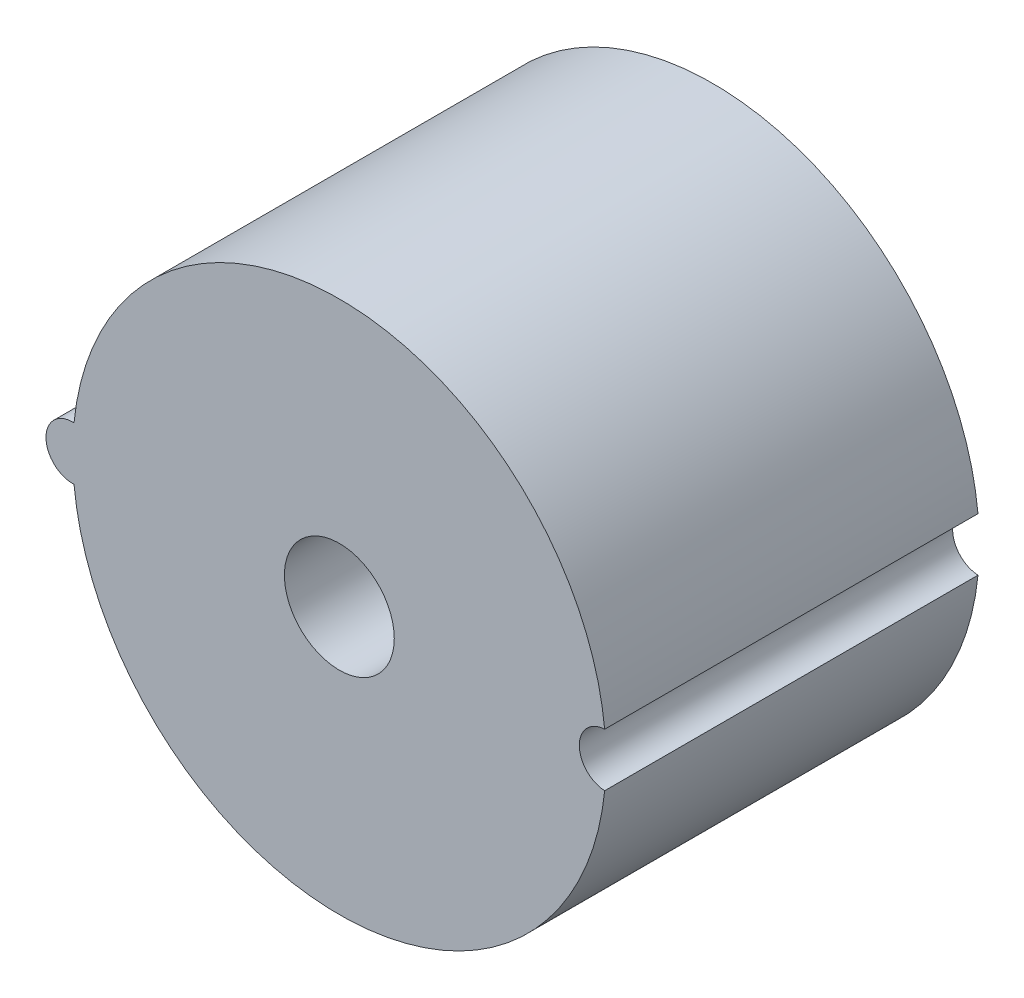
ISO-10303-21;
HEADER;
FILE_DESCRIPTION(('STEP AP214'),'2;1');
FILE_NAME('part.step','',(''),(''),'','','');
FILE_SCHEMA(('AUTOMOTIVE_DESIGN { 1 0 10303 214 1 1 1 1 }'));
ENDSEC;
DATA;
#1=APPLICATION_CONTEXT('core data for automotive mechanical design processes');
#2=APPLICATION_PROTOCOL_DEFINITION('international standard','automotive_design',2000,#1);
#3=PRODUCT_CONTEXT('',#1,'mechanical');
#4=PRODUCT('Part','Part','',(#3));
#5=PRODUCT_RELATED_PRODUCT_CATEGORY('part','',(#4));
#6=PRODUCT_DEFINITION_FORMATION('','',#4);
#7=PRODUCT_DEFINITION_CONTEXT('part definition',#1,'design');
#8=PRODUCT_DEFINITION('design','',#6,#7);
#9=PRODUCT_DEFINITION_SHAPE('','',#8);
#10=(LENGTH_UNIT() NAMED_UNIT(*) SI_UNIT(.MILLI.,.METRE.));
#11=(NAMED_UNIT(*) PLANE_ANGLE_UNIT() SI_UNIT($,.RADIAN.));
#12=(NAMED_UNIT(*) SI_UNIT($,.STERADIAN.) SOLID_ANGLE_UNIT());
#13=UNCERTAINTY_MEASURE_WITH_UNIT(LENGTH_MEASURE(1.E-05),#10,'distance_accuracy_value','');
#14=(GEOMETRIC_REPRESENTATION_CONTEXT(3) GLOBAL_UNCERTAINTY_ASSIGNED_CONTEXT((#13)) GLOBAL_UNIT_ASSIGNED_CONTEXT((#10,
#11,#12)) REPRESENTATION_CONTEXT('',''));
#15=CARTESIAN_POINT('',(0.,0.,0.));
#16=DIRECTION('',(0.,0.,1.));
#17=DIRECTION('',(1.,0.,0.));
#18=AXIS2_PLACEMENT_3D('',#15,#16,#17);
#19=CARTESIAN_POINT('',(0.,0.,22.225));
#20=DIRECTION('',(0.,0.,-1.));
#21=DIRECTION('',(-1.,0.,0.));
#22=AXIS2_PLACEMENT_3D('',#19,#20,#21);
#23=CYLINDRICAL_SURFACE('',#22,15.875);
#24=CARTESIAN_POINT('',(0.,0.,0.));
#25=DIRECTION('',(0.,0.,1.));
#26=DIRECTION('',(1.,0.,0.));
#27=AXIS2_PLACEMENT_3D('',#24,#25,#26);
#28=CIRCLE('',#27,15.875);
#29=CARTESIAN_POINT('',(15.795625,1.58551438321291,0.));
#30=VERTEX_POINT('',#29);
#31=CARTESIAN_POINT('',(-15.795625,1.58551438321291,0.));
#32=VERTEX_POINT('',#31);
#33=EDGE_CURVE('E85',#30,#32,#28,.T.);
#34=ORIENTED_EDGE('',*,*,#33,.T.);
#35=DIRECTION('',(0.,0.,1.));
#36=VECTOR('',#35,1.);
#37=CARTESIAN_POINT('',(-15.795625,1.58551438321291,11.1125));
#38=LINE('',#37,#36);
#39=CARTESIAN_POINT('',(-15.795625,1.58551438321291,22.225));
#40=VERTEX_POINT('',#39);
#41=EDGE_CURVE('E60',#32,#40,#38,.T.);
#42=ORIENTED_EDGE('',*,*,#41,.T.);
#43=CARTESIAN_POINT('',(0.,0.,22.225));
#44=DIRECTION('',(0.,0.,1.));
#45=DIRECTION('',(1.,0.,0.));
#46=AXIS2_PLACEMENT_3D('',#43,#44,#45);
#47=CIRCLE('',#46,15.875);
#48=CARTESIAN_POINT('',(15.795625,1.5855143832129,22.225));
#49=VERTEX_POINT('',#48);
#50=EDGE_CURVE('E45',#49,#40,#47,.T.);
#51=ORIENTED_EDGE('',*,*,#50,.F.);
#52=DIRECTION('',(0.,0.,1.));
#53=VECTOR('',#52,1.);
#54=CARTESIAN_POINT('',(15.795625,1.5855143832129,10.4775));
#55=LINE('',#54,#53);
#56=EDGE_CURVE('E102',#49,#30,#55,.F.);
#57=ORIENTED_EDGE('',*,*,#56,.T.);
#58=EDGE_LOOP('',(#34,#42,#51,#57));
#59=FACE_BOUND('',#58,.T.);
#60=ADVANCED_FACE('F37',(#59),#23,.T.);
#61=CARTESIAN_POINT('',(-15.795625,-1.58551438321291,22.225));
#62=VERTEX_POINT('',#61);
#63=CARTESIAN_POINT('',(15.795625,-1.5855143832129,22.225));
#64=VERTEX_POINT('',#63);
#65=EDGE_CURVE('E52',#62,#64,#47,.T.);
#66=ORIENTED_EDGE('',*,*,#65,.F.);
#67=DIRECTION('',(0.,0.,1.));
#68=VECTOR('',#67,1.);
#69=CARTESIAN_POINT('',(-15.795625,-1.58551438321291,11.1125));
#70=LINE('',#69,#68);
#71=CARTESIAN_POINT('',(-15.795625,-1.58551438321291,0.));
#72=VERTEX_POINT('',#71);
#73=EDGE_CURVE('E88',#62,#72,#70,.F.);
#74=ORIENTED_EDGE('',*,*,#73,.T.);
#75=CARTESIAN_POINT('',(15.795625,-1.58551438321291,0.));
#76=VERTEX_POINT('',#75);
#77=EDGE_CURVE('E79',#72,#76,#28,.T.);
#78=ORIENTED_EDGE('',*,*,#77,.T.);
#79=DIRECTION('',(0.,0.,1.));
#80=VECTOR('',#79,1.);
#81=CARTESIAN_POINT('',(15.795625,-1.5855143832129,10.4775));
#82=LINE('',#81,#80);
#83=EDGE_CURVE('E105',#76,#64,#82,.T.);
#84=ORIENTED_EDGE('',*,*,#83,.T.);
#85=EDGE_LOOP('',(#66,#74,#78,#84));
#86=FACE_BOUND('',#85,.T.);
#87=ADVANCED_FACE('F39',(#86),#23,.T.);
#88=CARTESIAN_POINT('',(0.,0.,22.225));
#89=DIRECTION('',(0.,0.,1.));
#90=DIRECTION('',(1.,0.,0.));
#91=AXIS2_PLACEMENT_3D('',#88,#89,#90);
#92=PLANE('',#91);
#93=ORIENTED_EDGE('',*,*,#50,.T.);
#94=CARTESIAN_POINT('',(-15.875,0.,22.225));
#95=DIRECTION('',(0.,0.,1.));
#96=DIRECTION('',(1.,0.,0.));
#97=AXIS2_PLACEMENT_3D('',#94,#95,#96);
#98=CIRCLE('',#97,1.5875);
#99=EDGE_CURVE('E94',#40,#62,#98,.T.);
#100=ORIENTED_EDGE('',*,*,#99,.T.);
#101=ORIENTED_EDGE('',*,*,#65,.T.);
#102=CARTESIAN_POINT('',(15.875,0.,22.225));
#103=DIRECTION('',(0.,0.,1.));
#104=DIRECTION('',(1.,0.,0.));
#105=AXIS2_PLACEMENT_3D('',#102,#103,#104);
#106=CIRCLE('',#105,1.5875);
#107=EDGE_CURVE('E99',#49,#64,#106,.T.);
#108=ORIENTED_EDGE('',*,*,#107,.F.);
#109=EDGE_LOOP('',(#93,#100,#101,#108));
#110=FACE_BOUND('',#109,.T.);
#111=CARTESIAN_POINT('',(0.,0.,22.225));
#112=DIRECTION('',(0.,0.,1.));
#113=DIRECTION('',(1.,0.,0.));
#114=AXIS2_PLACEMENT_3D('',#111,#112,#113);
#115=CIRCLE('',#114,3.27025);
#116=CARTESIAN_POINT('',(3.27025,0.,22.225));
#117=VERTEX_POINT('',#116);
#118=EDGE_CURVE('E107',#117,#117,#115,.T.);
#119=ORIENTED_EDGE('',*,*,#118,.F.);
#120=EDGE_LOOP('',(#119));
#121=FACE_BOUND('',#120,.T.);
#122=ADVANCED_FACE('F152',(#110,#121),#92,.T.);
#123=CARTESIAN_POINT('',(0.,0.,0.));
#124=DIRECTION('',(0.,0.,1.));
#125=DIRECTION('',(1.,0.,0.));
#126=AXIS2_PLACEMENT_3D('',#123,#124,#125);
#127=PLANE('',#126);
#128=CARTESIAN_POINT('',(0.,0.,0.));
#129=DIRECTION('',(0.,0.,1.));
#130=DIRECTION('',(1.,0.,0.));
#131=AXIS2_PLACEMENT_3D('',#128,#129,#130);
#132=CIRCLE('',#131,10.795);
#133=CARTESIAN_POINT('',(10.795,0.,0.));
#134=VERTEX_POINT('',#133);
#135=EDGE_CURVE('E120',#134,#134,#132,.T.);
#136=ORIENTED_EDGE('',*,*,#135,.T.);
#137=EDGE_LOOP('',(#136));
#138=FACE_BOUND('',#137,.T.);
#139=ORIENTED_EDGE('',*,*,#77,.F.);
#140=CARTESIAN_POINT('',(-15.875,0.,0.));
#141=DIRECTION('',(0.,0.,1.));
#142=DIRECTION('',(1.,0.,0.));
#143=AXIS2_PLACEMENT_3D('',#140,#141,#142);
#144=CIRCLE('',#143,1.5875);
#145=EDGE_CURVE('E83',#72,#32,#144,.F.);
#146=ORIENTED_EDGE('',*,*,#145,.T.);
#147=ORIENTED_EDGE('',*,*,#33,.F.);
#148=CARTESIAN_POINT('',(15.875,0.,0.));
#149=DIRECTION('',(0.,0.,1.));
#150=DIRECTION('',(1.,0.,0.));
#151=AXIS2_PLACEMENT_3D('',#148,#149,#150);
#152=CIRCLE('',#151,1.5875);
#153=EDGE_CURVE('E11',#30,#76,#152,.T.);
#154=ORIENTED_EDGE('',*,*,#153,.T.);
#155=EDGE_LOOP('',(#139,#146,#147,#154));
#156=FACE_BOUND('',#155,.T.);
#157=ADVANCED_FACE('F80',(#138,#156),#127,.F.);
#158=CARTESIAN_POINT('',(0.,0.,5.08));
#159=DIRECTION('',(0.,0.,-1.));
#160=DIRECTION('',(-1.,0.,0.));
#161=AXIS2_PLACEMENT_3D('',#158,#159,#160);
#162=CYLINDRICAL_SURFACE('',#161,10.795);
#163=CARTESIAN_POINT('',(0.,0.,5.08));
#164=DIRECTION('',(0.,0.,1.));
#165=DIRECTION('',(1.,0.,0.));
#166=AXIS2_PLACEMENT_3D('',#163,#164,#165);
#167=CIRCLE('',#166,10.795);
#168=CARTESIAN_POINT('',(10.795,0.,5.08));
#169=VERTEX_POINT('',#168);
#170=EDGE_CURVE('E86',#169,#169,#167,.T.);
#171=ORIENTED_EDGE('',*,*,#170,.T.);
#172=EDGE_LOOP('',(#171));
#173=FACE_BOUND('',#172,.T.);
#174=ORIENTED_EDGE('',*,*,#135,.F.);
#175=EDGE_LOOP('',(#174));
#176=FACE_BOUND('',#175,.T.);
#177=ADVANCED_FACE('F226',(#173,#176),#162,.F.);
#178=CARTESIAN_POINT('',(0.,0.,5.08));
#179=DIRECTION('',(0.,0.,1.));
#180=DIRECTION('',(1.,0.,0.));
#181=AXIS2_PLACEMENT_3D('',#178,#179,#180);
#182=PLANE('',#181);
#183=CARTESIAN_POINT('',(0.,0.,5.08));
#184=DIRECTION('',(0.,0.,1.));
#185=DIRECTION('',(1.,0.,0.));
#186=AXIS2_PLACEMENT_3D('',#183,#184,#185);
#187=CIRCLE('',#186,5.08);
#188=CARTESIAN_POINT('',(5.08,0.,5.08));
#189=VERTEX_POINT('',#188);
#190=EDGE_CURVE('E121',#189,#189,#187,.T.);
#191=ORIENTED_EDGE('',*,*,#190,.T.);
#192=EDGE_LOOP('',(#191));
#193=FACE_BOUND('',#192,.T.);
#194=ORIENTED_EDGE('',*,*,#170,.F.);
#195=EDGE_LOOP('',(#194));
#196=FACE_BOUND('',#195,.T.);
#197=ADVANCED_FACE('F216',(#193,#196),#182,.F.);
#198=CARTESIAN_POINT('',(0.,0.,4.191));
#199=DIRECTION('',(0.,0.,1.));
#200=DIRECTION('',(1.,0.,0.));
#201=AXIS2_PLACEMENT_3D('',#198,#199,#200);
#202=CYLINDRICAL_SURFACE('',#201,5.08);
#203=CARTESIAN_POINT('',(0.,0.,4.191));
#204=DIRECTION('',(0.,0.,1.));
#205=DIRECTION('',(1.,0.,0.));
#206=AXIS2_PLACEMENT_3D('',#203,#204,#205);
#207=CIRCLE('',#206,5.08);
#208=CARTESIAN_POINT('',(5.08,0.,4.191));
#209=VERTEX_POINT('',#208);
#210=EDGE_CURVE('E117',#209,#209,#207,.T.);
#211=ORIENTED_EDGE('',*,*,#210,.T.);
#212=EDGE_LOOP('',(#211));
#213=FACE_BOUND('',#212,.T.);
#214=ORIENTED_EDGE('',*,*,#190,.F.);
#215=EDGE_LOOP('',(#214));
#216=FACE_BOUND('',#215,.T.);
#217=ADVANCED_FACE('F146',(#213,#216),#202,.T.);
#218=CARTESIAN_POINT('',(0.,0.,4.191));
#219=DIRECTION('',(0.,0.,1.));
#220=DIRECTION('',(1.,0.,0.));
#221=AXIS2_PLACEMENT_3D('',#218,#219,#220);
#222=PLANE('',#221);
#223=CARTESIAN_POINT('',(0.,0.,4.191));
#224=DIRECTION('',(0.,0.,1.));
#225=DIRECTION('',(1.,0.,0.));
#226=AXIS2_PLACEMENT_3D('',#223,#224,#225);
#227=CIRCLE('',#226,3.175);
#228=CARTESIAN_POINT('',(3.175,0.,4.191));
#229=VERTEX_POINT('',#228);
#230=EDGE_CURVE('E116',#229,#229,#227,.T.);
#231=ORIENTED_EDGE('',*,*,#230,.T.);
#232=EDGE_LOOP('',(#231));
#233=FACE_BOUND('',#232,.T.);
#234=ORIENTED_EDGE('',*,*,#210,.F.);
#235=EDGE_LOOP('',(#234));
#236=FACE_BOUND('',#235,.T.);
#237=ADVANCED_FACE('F131',(#233,#236),#222,.F.);
#238=CARTESIAN_POINT('',(0.,0.,-1.27));
#239=DIRECTION('',(0.,0.,1.));
#240=DIRECTION('',(1.,0.,0.));
#241=AXIS2_PLACEMENT_3D('',#238,#239,#240);
#242=CYLINDRICAL_SURFACE('',#241,3.175);
#243=CARTESIAN_POINT('',(0.,0.,-1.27));
#244=DIRECTION('',(0.,0.,1.));
#245=DIRECTION('',(1.,0.,0.));
#246=AXIS2_PLACEMENT_3D('',#243,#244,#245);
#247=CIRCLE('',#246,3.175);
#248=CARTESIAN_POINT('',(3.175,0.,-1.27));
#249=VERTEX_POINT('',#248);
#250=EDGE_CURVE('E111',#249,#249,#247,.T.);
#251=ORIENTED_EDGE('',*,*,#250,.T.);
#252=EDGE_LOOP('',(#251));
#253=FACE_BOUND('',#252,.T.);
#254=ORIENTED_EDGE('',*,*,#230,.F.);
#255=EDGE_LOOP('',(#254));
#256=FACE_BOUND('',#255,.T.);
#257=ADVANCED_FACE('F134',(#253,#256),#242,.T.);
#258=CARTESIAN_POINT('',(0.,0.,-1.27));
#259=DIRECTION('',(0.,0.,1.));
#260=DIRECTION('',(1.,0.,0.));
#261=AXIS2_PLACEMENT_3D('',#258,#259,#260);
#262=PLANE('',#261);
#263=ORIENTED_EDGE('',*,*,#250,.F.);
#264=EDGE_LOOP('',(#263));
#265=FACE_BOUND('',#264,.T.);
#266=ADVANCED_FACE('F136',(#265),#262,.F.);
#267=CARTESIAN_POINT('',(0.,0.,9.525));
#268=DIRECTION('',(0.,0.,1.));
#269=DIRECTION('',(1.,0.,0.));
#270=AXIS2_PLACEMENT_3D('',#267,#268,#269);
#271=CYLINDRICAL_SURFACE('',#270,3.27025);
#272=CARTESIAN_POINT('',(0.,0.,9.525));
#273=DIRECTION('',(0.,0.,1.));
#274=DIRECTION('',(1.,0.,0.));
#275=AXIS2_PLACEMENT_3D('',#272,#273,#274);
#276=CIRCLE('',#275,3.27025);
#277=CARTESIAN_POINT('',(3.27025,0.,9.525));
#278=VERTEX_POINT('',#277);
#279=EDGE_CURVE('E108',#278,#278,#276,.T.);
#280=ORIENTED_EDGE('',*,*,#279,.F.);
#281=EDGE_LOOP('',(#280));
#282=FACE_BOUND('',#281,.T.);
#283=ORIENTED_EDGE('',*,*,#118,.T.);
#284=EDGE_LOOP('',(#283));
#285=FACE_BOUND('',#284,.T.);
#286=ADVANCED_FACE('F143',(#282,#285),#271,.F.);
#287=CARTESIAN_POINT('',(0.,0.,9.525));
#288=DIRECTION('',(0.,0.,1.));
#289=DIRECTION('',(1.,0.,0.));
#290=AXIS2_PLACEMENT_3D('',#287,#288,#289);
#291=PLANE('',#290);
#292=ORIENTED_EDGE('',*,*,#279,.T.);
#293=EDGE_LOOP('',(#292));
#294=FACE_BOUND('',#293,.T.);
#295=ADVANCED_FACE('F163',(#294),#291,.T.);
#296=CARTESIAN_POINT('',(15.875,0.,-1.27));
#297=DIRECTION('',(0.,0.,1.));
#298=DIRECTION('',(1.,0.,0.));
#299=AXIS2_PLACEMENT_3D('',#296,#297,#298);
#300=CYLINDRICAL_SURFACE('',#299,1.5875);
#301=ORIENTED_EDGE('',*,*,#153,.F.);
#302=ORIENTED_EDGE('',*,*,#56,.F.);
#303=ORIENTED_EDGE('',*,*,#107,.T.);
#304=ORIENTED_EDGE('',*,*,#83,.F.);
#305=EDGE_LOOP('',(#301,#302,#303,#304));
#306=FACE_BOUND('',#305,.T.);
#307=ADVANCED_FACE('F155',(#306),#300,.F.);
#308=CARTESIAN_POINT('',(-15.875,0.,-4.49012806053458));
#309=DIRECTION('',(0.,0.,1.));
#310=DIRECTION('',(1.,0.,0.));
#311=AXIS2_PLACEMENT_3D('',#308,#309,#310);
#312=CYLINDRICAL_SURFACE('',#311,1.5875);
#313=ORIENTED_EDGE('',*,*,#41,.F.);
#314=ORIENTED_EDGE('',*,*,#145,.F.);
#315=ORIENTED_EDGE('',*,*,#73,.F.);
#316=ORIENTED_EDGE('',*,*,#99,.F.);
#317=EDGE_LOOP('',(#313,#314,#315,#316));
#318=FACE_BOUND('',#317,.T.);
#319=ADVANCED_FACE('F93',(#318),#312,.T.);
#320=CLOSED_SHELL('',(#60,#87,#122,#157,#177,#197,#217,#237,#257,#266,#286,#295,#307,#319));
#321=MANIFOLD_SOLID_BREP('B2',#320);
#322=ADVANCED_BREP_SHAPE_REPRESENTATION('',(#18,#321),#14);
#323=SHAPE_DEFINITION_REPRESENTATION(#9,#322);
ENDSEC;
END-ISO-10303-21;
